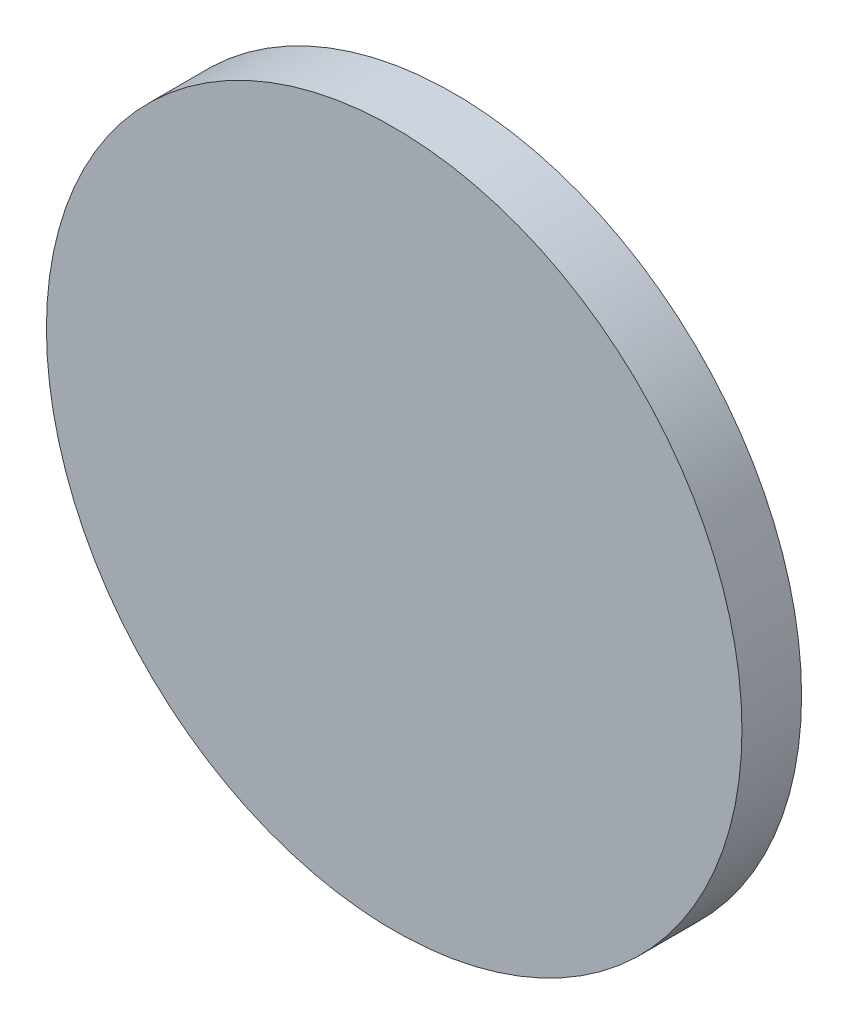
ISO-10303-21;
HEADER;
FILE_DESCRIPTION(('STEP AP214'),'2;1');
FILE_NAME('part.step','',(''),(''),'','','');
FILE_SCHEMA(('AUTOMOTIVE_DESIGN { 1 0 10303 214 1 1 1 1 }'));
ENDSEC;
DATA;
#1=APPLICATION_CONTEXT('core data for automotive mechanical design processes');
#2=APPLICATION_PROTOCOL_DEFINITION('international standard','automotive_design',2000,#1);
#3=PRODUCT_CONTEXT('',#1,'mechanical');
#4=PRODUCT('Part','Part','',(#3));
#5=PRODUCT_RELATED_PRODUCT_CATEGORY('part','',(#4));
#6=PRODUCT_DEFINITION_FORMATION('','',#4);
#7=PRODUCT_DEFINITION_CONTEXT('part definition',#1,'design');
#8=PRODUCT_DEFINITION('design','',#6,#7);
#9=PRODUCT_DEFINITION_SHAPE('','',#8);
#10=(LENGTH_UNIT() NAMED_UNIT(*) SI_UNIT(.MILLI.,.METRE.));
#11=(NAMED_UNIT(*) PLANE_ANGLE_UNIT() SI_UNIT($,.RADIAN.));
#12=(NAMED_UNIT(*) SI_UNIT($,.STERADIAN.) SOLID_ANGLE_UNIT());
#13=UNCERTAINTY_MEASURE_WITH_UNIT(LENGTH_MEASURE(1.E-05),#10,'distance_accuracy_value','');
#14=(GEOMETRIC_REPRESENTATION_CONTEXT(3) GLOBAL_UNCERTAINTY_ASSIGNED_CONTEXT((#13)) GLOBAL_UNIT_ASSIGNED_CONTEXT((#10,
#11,#12)) REPRESENTATION_CONTEXT('',''));
#15=CARTESIAN_POINT('',(0.,0.,0.));
#16=DIRECTION('',(0.,0.,1.));
#17=DIRECTION('',(1.,0.,0.));
#18=AXIS2_PLACEMENT_3D('',#15,#16,#17);
#19=CARTESIAN_POINT('',(10.771,3.661000014875,0.76487));
#20=DIRECTION('',(0.,0.,-1.));
#21=DIRECTION('',(-1.,0.,0.));
#22=AXIS2_PLACEMENT_3D('',#19,#20,#21);
#23=PLANE('',#22);
#24=CARTESIAN_POINT('',(10.771,3.661000014875,0.76487));
#25=DIRECTION('',(0.,0.,1.));
#26=DIRECTION('',(1.,0.,0.));
#27=AXIS2_PLACEMENT_3D('',#24,#25,#26);
#28=CIRCLE('',#27,0.200024667);
#29=CARTESIAN_POINT('',(10.971024667,3.661000014875,0.76487));
#30=VERTEX_POINT('',#29);
#31=EDGE_CURVE('E18',#30,#30,#28,.T.);
#32=ORIENTED_EDGE('',*,*,#31,.F.);
#33=EDGE_LOOP('',(#32));
#34=FACE_BOUND('',#33,.T.);
#35=ADVANCED_FACE('F15',(#34),#23,.T.);
#36=CARTESIAN_POINT('',(10.771,3.661000014875,0.76487));
#37=DIRECTION('',(0.,0.,1.));
#38=DIRECTION('',(1.,0.,0.));
#39=AXIS2_PLACEMENT_3D('',#36,#37,#38);
#40=CYLINDRICAL_SURFACE('',#39,0.200024667);
#41=CARTESIAN_POINT('',(10.771,3.661000014875,0.79916));
#42=DIRECTION('',(0.,0.,1.));
#43=DIRECTION('',(1.,0.,0.));
#44=AXIS2_PLACEMENT_3D('',#41,#42,#43);
#45=CIRCLE('',#44,0.200024667);
#46=CARTESIAN_POINT('',(10.971024667,3.661000014875,0.79916));
#47=VERTEX_POINT('',#46);
#48=EDGE_CURVE('E10',#47,#47,#45,.T.);
#49=ORIENTED_EDGE('',*,*,#48,.F.);
#50=EDGE_LOOP('',(#49));
#51=FACE_BOUND('',#50,.T.);
#52=ORIENTED_EDGE('',*,*,#31,.T.);
#53=EDGE_LOOP('',(#52));
#54=FACE_BOUND('',#53,.T.);
#55=ADVANCED_FACE('F27',(#51,#54),#40,.T.);
#56=CARTESIAN_POINT('',(10.771,3.661000014875,0.79916));
#57=DIRECTION('',(0.,0.,1.));
#58=DIRECTION('',(1.,0.,0.));
#59=AXIS2_PLACEMENT_3D('',#56,#57,#58);
#60=PLANE('',#59);
#61=ORIENTED_EDGE('',*,*,#48,.T.);
#62=EDGE_LOOP('',(#61));
#63=FACE_BOUND('',#62,.T.);
#64=ADVANCED_FACE('F34',(#63),#60,.T.);
#65=CLOSED_SHELL('',(#35,#55,#64));
#66=MANIFOLD_SOLID_BREP('B1',#65);
#67=ADVANCED_BREP_SHAPE_REPRESENTATION('',(#18,#66),#14);
#68=SHAPE_DEFINITION_REPRESENTATION(#9,#67);
ENDSEC;
END-ISO-10303-21;
